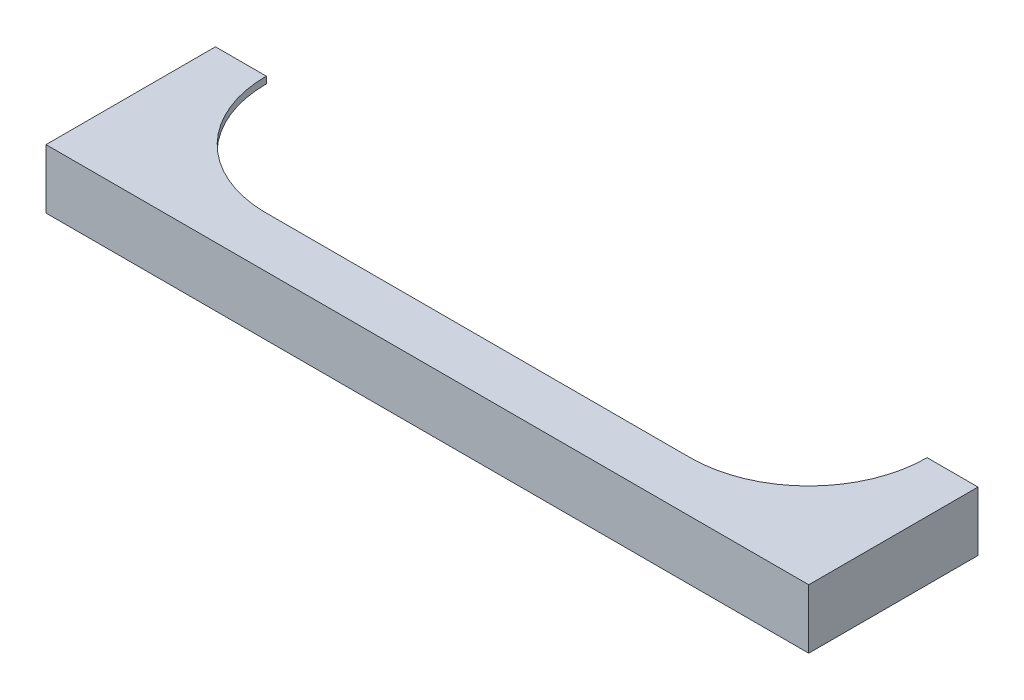
ISO-10303-21;
HEADER;
FILE_DESCRIPTION(('STEP AP214'),'2;1');
FILE_NAME('part.step','',(''),(''),'','','');
FILE_SCHEMA(('AUTOMOTIVE_DESIGN { 1 0 10303 214 1 1 1 1 }'));
ENDSEC;
DATA;
#1=APPLICATION_CONTEXT('core data for automotive mechanical design processes');
#2=APPLICATION_PROTOCOL_DEFINITION('international standard','automotive_design',2000,#1);
#3=PRODUCT_CONTEXT('',#1,'mechanical');
#4=PRODUCT('Part','Part','',(#3));
#5=PRODUCT_RELATED_PRODUCT_CATEGORY('part','',(#4));
#6=PRODUCT_DEFINITION_FORMATION('','',#4);
#7=PRODUCT_DEFINITION_CONTEXT('part definition',#1,'design');
#8=PRODUCT_DEFINITION('design','',#6,#7);
#9=PRODUCT_DEFINITION_SHAPE('','',#8);
#10=(LENGTH_UNIT() NAMED_UNIT(*) SI_UNIT(.MILLI.,.METRE.));
#11=(NAMED_UNIT(*) PLANE_ANGLE_UNIT() SI_UNIT($,.RADIAN.));
#12=(NAMED_UNIT(*) SI_UNIT($,.STERADIAN.) SOLID_ANGLE_UNIT());
#13=UNCERTAINTY_MEASURE_WITH_UNIT(LENGTH_MEASURE(1.E-05),#10,'distance_accuracy_value','');
#14=(GEOMETRIC_REPRESENTATION_CONTEXT(3) GLOBAL_UNCERTAINTY_ASSIGNED_CONTEXT((#13)) GLOBAL_UNIT_ASSIGNED_CONTEXT((#10,
#11,#12)) REPRESENTATION_CONTEXT('',''));
#15=CARTESIAN_POINT('',(0.,0.,0.));
#16=DIRECTION('',(0.,0.,1.));
#17=DIRECTION('',(1.,0.,0.));
#18=AXIS2_PLACEMENT_3D('',#15,#16,#17);
#19=CARTESIAN_POINT('',(-2500.,700.,-2000.));
#20=DIRECTION('',(0.,-1.,0.));
#21=DIRECTION('',(0.,0.,-1.));
#22=AXIS2_PLACEMENT_3D('',#19,#20,#21);
#23=CYLINDRICAL_SURFACE('',#22,1400.);
#24=CARTESIAN_POINT('',(-2500.,620.,-2000.));
#25=DIRECTION('',(0.,-1.,0.));
#26=DIRECTION('',(0.,0.,-1.));
#27=AXIS2_PLACEMENT_3D('',#24,#25,#26);
#28=CIRCLE('',#27,1400.);
#29=CARTESIAN_POINT('',(-3900.,620.,-2000.));
#30=VERTEX_POINT('',#29);
#31=CARTESIAN_POINT('',(-2537.88413687999,620.,-600.512668091326));
#32=VERTEX_POINT('',#31);
#33=EDGE_CURVE('E171',#30,#32,#28,.F.);
#34=ORIENTED_EDGE('',*,*,#33,.F.);
#35=DIRECTION('',(0.,-1.,0.));
#36=VECTOR('',#35,1.);
#37=CARTESIAN_POINT('',(-3900.,700.,-2000.));
#38=LINE('',#37,#36);
#39=CARTESIAN_POINT('',(-3900.,700.,-2000.));
#40=VERTEX_POINT('',#39);
#41=EDGE_CURVE('E46',#40,#30,#38,.T.);
#42=ORIENTED_EDGE('',*,*,#41,.F.);
#43=CARTESIAN_POINT('',(-2500.,700.,-2000.));
#44=DIRECTION('',(0.,-1.,0.));
#45=DIRECTION('',(0.,0.,1.));
#46=AXIS2_PLACEMENT_3D('',#43,#44,#45);
#47=CIRCLE('',#46,1400.);
#48=CARTESIAN_POINT('',(-2537.88413687999,700.,-600.512668091326));
#49=VERTEX_POINT('',#48);
#50=EDGE_CURVE('E149',#49,#40,#47,.T.);
#51=ORIENTED_EDGE('',*,*,#50,.F.);
#52=DIRECTION('',(0.,-1.,0.));
#53=VECTOR('',#52,1.);
#54=CARTESIAN_POINT('',(-2537.88413687999,700.,-600.512668091326));
#55=LINE('',#54,#53);
#56=EDGE_CURVE('E134',#49,#32,#55,.T.);
#57=ORIENTED_EDGE('',*,*,#56,.T.);
#58=EDGE_LOOP('',(#34,#42,#51,#57));
#59=FACE_BOUND('',#58,.T.);
#60=ADVANCED_FACE('F39',(#59),#23,.F.);
#61=CARTESIAN_POINT('',(-4500.,700.,-2000.));
#62=DIRECTION('',(0.,0.,1.));
#63=DIRECTION('',(1.,0.,0.));
#64=AXIS2_PLACEMENT_3D('',#61,#62,#63);
#65=PLANE('',#64);
#66=DIRECTION('',(1.,0.,0.));
#67=VECTOR('',#66,1.);
#68=CARTESIAN_POINT('',(-4500.,620.,-2000.));
#69=LINE('',#68,#67);
#70=CARTESIAN_POINT('',(-4460.,620.,-2000.));
#71=VERTEX_POINT('',#70);
#72=EDGE_CURVE('E141',#71,#30,#69,.T.);
#73=ORIENTED_EDGE('',*,*,#72,.F.);
#74=DIRECTION('',(0.,1.,0.));
#75=VECTOR('',#74,1.);
#76=CARTESIAN_POINT('',(-4460.,700.,-2000.));
#77=LINE('',#76,#75);
#78=CARTESIAN_POINT('',(-4460.,0.,-2000.));
#79=VERTEX_POINT('',#78);
#80=EDGE_CURVE('E221',#79,#71,#77,.T.);
#81=ORIENTED_EDGE('',*,*,#80,.F.);
#82=DIRECTION('',(-1.,0.,0.));
#83=VECTOR('',#82,1.);
#84=CARTESIAN_POINT('',(-4500.,0.,-2000.));
#85=LINE('',#84,#83);
#86=CARTESIAN_POINT('',(-4500.,0.,-2000.));
#87=VERTEX_POINT('',#86);
#88=EDGE_CURVE('E138',#79,#87,#85,.T.);
#89=ORIENTED_EDGE('',*,*,#88,.T.);
#90=DIRECTION('',(0.,-1.,0.));
#91=VECTOR('',#90,1.);
#92=CARTESIAN_POINT('',(-4500.,700.,-2000.));
#93=LINE('',#92,#91);
#94=CARTESIAN_POINT('',(-4500.,700.,-2000.));
#95=VERTEX_POINT('',#94);
#96=EDGE_CURVE('E159',#95,#87,#93,.T.);
#97=ORIENTED_EDGE('',*,*,#96,.F.);
#98=DIRECTION('',(-1.,0.,0.));
#99=VECTOR('',#98,1.);
#100=CARTESIAN_POINT('',(-4500.,700.,-2000.));
#101=LINE('',#100,#99);
#102=EDGE_CURVE('E93',#40,#95,#101,.T.);
#103=ORIENTED_EDGE('',*,*,#102,.F.);
#104=ORIENTED_EDGE('',*,*,#41,.T.);
#105=EDGE_LOOP('',(#73,#81,#89,#97,#103,#104));
#106=FACE_BOUND('',#105,.T.);
#107=ADVANCED_FACE('F163',(#106),#65,.F.);
#108=CARTESIAN_POINT('',(4500.,700.,-2000.));
#109=DIRECTION('',(0.,0.,1.));
#110=DIRECTION('',(1.,0.,0.));
#111=AXIS2_PLACEMENT_3D('',#108,#109,#110);
#112=PLANE('',#111);
#113=DIRECTION('',(0.,-1.,0.));
#114=VECTOR('',#113,1.);
#115=CARTESIAN_POINT('',(4460.,700.,-2000.));
#116=LINE('',#115,#114);
#117=CARTESIAN_POINT('',(4460.,620.,-2000.));
#118=VERTEX_POINT('',#117);
#119=CARTESIAN_POINT('',(4460.,0.,-2000.));
#120=VERTEX_POINT('',#119);
#121=EDGE_CURVE('E224',#118,#120,#116,.T.);
#122=ORIENTED_EDGE('',*,*,#121,.F.);
#123=DIRECTION('',(1.,0.,0.));
#124=VECTOR('',#123,1.);
#125=CARTESIAN_POINT('',(4500.,620.,-2000.));
#126=LINE('',#125,#124);
#127=CARTESIAN_POINT('',(3900.,620.,-2000.));
#128=VERTEX_POINT('',#127);
#129=EDGE_CURVE('E125',#128,#118,#126,.T.);
#130=ORIENTED_EDGE('',*,*,#129,.F.);
#131=DIRECTION('',(0.,-1.,0.));
#132=VECTOR('',#131,1.);
#133=CARTESIAN_POINT('',(3900.,700.,-2000.));
#134=LINE('',#133,#132);
#135=CARTESIAN_POINT('',(3900.,700.,-2000.));
#136=VERTEX_POINT('',#135);
#137=EDGE_CURVE('E120',#136,#128,#134,.T.);
#138=ORIENTED_EDGE('',*,*,#137,.F.);
#139=DIRECTION('',(-1.,0.,0.));
#140=VECTOR('',#139,1.);
#141=CARTESIAN_POINT('',(4500.,700.,-2000.));
#142=LINE('',#141,#140);
#143=CARTESIAN_POINT('',(4500.,700.,-2000.));
#144=VERTEX_POINT('',#143);
#145=EDGE_CURVE('E108',#144,#136,#142,.T.);
#146=ORIENTED_EDGE('',*,*,#145,.F.);
#147=DIRECTION('',(0.,-1.,0.));
#148=VECTOR('',#147,1.);
#149=CARTESIAN_POINT('',(4500.,700.,-2000.));
#150=LINE('',#149,#148);
#151=CARTESIAN_POINT('',(4500.,0.,-2000.));
#152=VERTEX_POINT('',#151);
#153=EDGE_CURVE('E128',#144,#152,#150,.T.);
#154=ORIENTED_EDGE('',*,*,#153,.T.);
#155=DIRECTION('',(-1.,0.,0.));
#156=VECTOR('',#155,1.);
#157=CARTESIAN_POINT('',(4500.,0.,-2000.));
#158=LINE('',#157,#156);
#159=EDGE_CURVE('E146',#152,#120,#158,.T.);
#160=ORIENTED_EDGE('',*,*,#159,.T.);
#161=EDGE_LOOP('',(#122,#130,#138,#146,#154,#160));
#162=FACE_BOUND('',#161,.T.);
#163=ADVANCED_FACE('F122',(#162),#112,.F.);
#164=CARTESIAN_POINT('',(2501.82940843479,700.,-2000.));
#165=DIRECTION('',(0.,-1.,0.));
#166=DIRECTION('',(0.,0.,-1.));
#167=AXIS2_PLACEMENT_3D('',#164,#165,#166);
#168=CYLINDRICAL_SURFACE('',#167,1398.17059156521);
#169=CARTESIAN_POINT('',(2501.82940843479,620.,-2000.));
#170=DIRECTION('',(0.,-1.,0.));
#171=DIRECTION('',(0.,0.,-1.));
#172=AXIS2_PLACEMENT_3D('',#169,#170,#171);
#173=CIRCLE('',#172,1398.17059156521);
#174=CARTESIAN_POINT('',(2501.82940843479,620.,-601.829408434792));
#175=VERTEX_POINT('',#174);
#176=EDGE_CURVE('E177',#175,#128,#173,.F.);
#177=ORIENTED_EDGE('',*,*,#176,.F.);
#178=DIRECTION('',(0.,-1.,0.));
#179=VECTOR('',#178,1.);
#180=CARTESIAN_POINT('',(2501.82940843479,700.,-601.829408434792));
#181=LINE('',#180,#179);
#182=CARTESIAN_POINT('',(2501.82940843479,700.,-601.829408434792));
#183=VERTEX_POINT('',#182);
#184=EDGE_CURVE('E129',#183,#175,#181,.T.);
#185=ORIENTED_EDGE('',*,*,#184,.F.);
#186=CARTESIAN_POINT('',(2501.82940843479,700.,-2000.));
#187=DIRECTION('',(0.,-1.,0.));
#188=DIRECTION('',(0.,0.,-1.));
#189=AXIS2_PLACEMENT_3D('',#186,#187,#188);
#190=CIRCLE('',#189,1398.17059156521);
#191=EDGE_CURVE('E112',#136,#183,#190,.T.);
#192=ORIENTED_EDGE('',*,*,#191,.F.);
#193=ORIENTED_EDGE('',*,*,#137,.T.);
#194=EDGE_LOOP('',(#177,#185,#192,#193));
#195=FACE_BOUND('',#194,.T.);
#196=ADVANCED_FACE('F131',(#195),#168,.F.);
#197=CARTESIAN_POINT('',(-2537.88413687999,700.,-600.512668091326));
#198=DIRECTION('',(0.000261272845506619,0.,0.999999965868249));
#199=DIRECTION('',(0.99999996586825,0.,-0.000261272845506619));
#200=AXIS2_PLACEMENT_3D('',#197,#198,#199);
#201=PLANE('',#200);
#202=DIRECTION('',(0.99999996586825,0.,-0.000261272845506619));
#203=VECTOR('',#202,1.);
#204=CARTESIAN_POINT('',(-2537.88413687999,620.,-600.512668091326));
#205=LINE('',#204,#203);
#206=EDGE_CURVE('E11',#32,#175,#205,.T.);
#207=ORIENTED_EDGE('',*,*,#206,.F.);
#208=ORIENTED_EDGE('',*,*,#56,.F.);
#209=DIRECTION('',(-0.99999996586825,0.,0.000261272845506619));
#210=VECTOR('',#209,1.);
#211=CARTESIAN_POINT('',(-2537.88413687999,700.,-600.512668091326));
#212=LINE('',#211,#210);
#213=EDGE_CURVE('E62',#183,#49,#212,.T.);
#214=ORIENTED_EDGE('',*,*,#213,.F.);
#215=ORIENTED_EDGE('',*,*,#184,.T.);
#216=EDGE_LOOP('',(#207,#208,#214,#215));
#217=FACE_BOUND('',#216,.T.);
#218=ADVANCED_FACE('F231',(#217),#201,.F.);
#219=CARTESIAN_POINT('',(-2500.,0.,-2000.));
#220=DIRECTION('',(0.,1.,0.));
#221=DIRECTION('',(0.,0.,1.));
#222=AXIS2_PLACEMENT_3D('',#219,#220,#221);
#223=PLANE('',#222);
#224=DIRECTION('',(0.,0.,-1.));
#225=VECTOR('',#224,1.);
#226=CARTESIAN_POINT('',(4460.,0.,-100.));
#227=LINE('',#226,#225);
#228=CARTESIAN_POINT('',(4460.,0.,-100.));
#229=VERTEX_POINT('',#228);
#230=EDGE_CURVE('E200',#229,#120,#227,.T.);
#231=ORIENTED_EDGE('',*,*,#230,.T.);
#232=ORIENTED_EDGE('',*,*,#159,.F.);
#233=DIRECTION('',(1.53773673066563E-07,0.,-0.999999999999988));
#234=VECTOR('',#233,1.);
#235=CARTESIAN_POINT('',(4499.99969281425,0.,-2.35145560956131));
#236=LINE('',#235,#234);
#237=CARTESIAN_POINT('',(4499.99969281425,0.,-2.35145560956131));
#238=VERTEX_POINT('',#237);
#239=EDGE_CURVE('E84',#238,#152,#236,.T.);
#240=ORIENTED_EDGE('',*,*,#239,.F.);
#241=DIRECTION('',(0.999999965868249,0.,-0.000261272845506812));
#242=VECTOR('',#241,1.);
#243=CARTESIAN_POINT('',(-4500.,0.,0.));
#244=LINE('',#243,#242);
#245=CARTESIAN_POINT('',(-4500.,0.,0.));
#246=VERTEX_POINT('',#245);
#247=EDGE_CURVE('E143',#246,#238,#244,.T.);
#248=ORIENTED_EDGE('',*,*,#247,.F.);
#249=DIRECTION('',(0.,0.,1.));
#250=VECTOR('',#249,1.);
#251=CARTESIAN_POINT('',(-4500.,0.,0.));
#252=LINE('',#251,#250);
#253=EDGE_CURVE('E140',#87,#246,#252,.T.);
#254=ORIENTED_EDGE('',*,*,#253,.F.);
#255=ORIENTED_EDGE('',*,*,#88,.F.);
#256=DIRECTION('',(0.,0.,-1.));
#257=VECTOR('',#256,1.);
#258=CARTESIAN_POINT('',(-4460.,0.,-100.));
#259=LINE('',#258,#257);
#260=CARTESIAN_POINT('',(-4460.,0.,-100.));
#261=VERTEX_POINT('',#260);
#262=EDGE_CURVE('E207',#261,#79,#259,.T.);
#263=ORIENTED_EDGE('',*,*,#262,.F.);
#264=DIRECTION('',(1.,0.,0.));
#265=VECTOR('',#264,1.);
#266=CARTESIAN_POINT('',(-4460.,0.,-100.));
#267=LINE('',#266,#265);
#268=EDGE_CURVE('E202',#261,#229,#267,.T.);
#269=ORIENTED_EDGE('',*,*,#268,.T.);
#270=EDGE_LOOP('',(#231,#232,#240,#248,#254,#255,#263,#269));
#271=FACE_BOUND('',#270,.T.);
#272=ADVANCED_FACE('F198',(#271),#223,.F.);
#273=CARTESIAN_POINT('',(-4500.,700.,0.));
#274=DIRECTION('',(1.,0.,0.));
#275=DIRECTION('',(0.,0.,-1.));
#276=AXIS2_PLACEMENT_3D('',#273,#274,#275);
#277=PLANE('',#276);
#278=ORIENTED_EDGE('',*,*,#253,.T.);
#279=DIRECTION('',(0.,-1.,0.));
#280=VECTOR('',#279,1.);
#281=CARTESIAN_POINT('',(-4500.,700.,0.));
#282=LINE('',#281,#280);
#283=CARTESIAN_POINT('',(-4500.,700.,0.));
#284=VERTEX_POINT('',#283);
#285=EDGE_CURVE('E156',#284,#246,#282,.T.);
#286=ORIENTED_EDGE('',*,*,#285,.F.);
#287=DIRECTION('',(0.,0.,1.));
#288=VECTOR('',#287,1.);
#289=CARTESIAN_POINT('',(-4500.,700.,0.));
#290=LINE('',#289,#288);
#291=EDGE_CURVE('E183',#95,#284,#290,.T.);
#292=ORIENTED_EDGE('',*,*,#291,.F.);
#293=ORIENTED_EDGE('',*,*,#96,.T.);
#294=EDGE_LOOP('',(#278,#286,#292,#293));
#295=FACE_BOUND('',#294,.T.);
#296=ADVANCED_FACE('F257',(#295),#277,.F.);
#297=CARTESIAN_POINT('',(-4500.,700.,0.));
#298=DIRECTION('',(-0.000261272845506812,0.,-0.999999965868249));
#299=DIRECTION('',(-0.99999996586825,0.,0.000261272845506812));
#300=AXIS2_PLACEMENT_3D('',#297,#298,#299);
#301=PLANE('',#300);
#302=ORIENTED_EDGE('',*,*,#247,.T.);
#303=DIRECTION('',(0.,-1.,0.));
#304=VECTOR('',#303,1.);
#305=CARTESIAN_POINT('',(4499.99969281425,700.,-2.35145560956131));
#306=LINE('',#305,#304);
#307=CARTESIAN_POINT('',(4499.99969281425,700.,-2.35145560956131));
#308=VERTEX_POINT('',#307);
#309=EDGE_CURVE('E154',#308,#238,#306,.T.);
#310=ORIENTED_EDGE('',*,*,#309,.F.);
#311=DIRECTION('',(0.999999965868249,0.,-0.000261272845506812));
#312=VECTOR('',#311,1.);
#313=CARTESIAN_POINT('',(-4500.,700.,0.));
#314=LINE('',#313,#312);
#315=EDGE_CURVE('E185',#284,#308,#314,.T.);
#316=ORIENTED_EDGE('',*,*,#315,.F.);
#317=ORIENTED_EDGE('',*,*,#285,.T.);
#318=EDGE_LOOP('',(#302,#310,#316,#317));
#319=FACE_BOUND('',#318,.T.);
#320=ADVANCED_FACE('F191',(#319),#301,.F.);
#321=CARTESIAN_POINT('',(4499.99969281425,700.,-2.35145560956131));
#322=DIRECTION('',(-0.999999999999988,0.,-1.53773673066563E-07));
#323=DIRECTION('',(-1.53773673066563E-07,0.,0.999999999999988));
#324=AXIS2_PLACEMENT_3D('',#321,#322,#323);
#325=PLANE('',#324);
#326=ORIENTED_EDGE('',*,*,#239,.T.);
#327=ORIENTED_EDGE('',*,*,#153,.F.);
#328=DIRECTION('',(1.53773673066563E-07,0.,-0.999999999999988));
#329=VECTOR('',#328,1.);
#330=CARTESIAN_POINT('',(4499.99969281425,700.,-2.35145560956131));
#331=LINE('',#330,#329);
#332=EDGE_CURVE('E115',#308,#144,#331,.T.);
#333=ORIENTED_EDGE('',*,*,#332,.F.);
#334=ORIENTED_EDGE('',*,*,#309,.T.);
#335=EDGE_LOOP('',(#326,#327,#333,#334));
#336=FACE_BOUND('',#335,.T.);
#337=ADVANCED_FACE('F193',(#336),#325,.F.);
#338=CARTESIAN_POINT('',(-2500.,700.,-2000.));
#339=DIRECTION('',(0.,1.,0.));
#340=DIRECTION('',(0.,0.,1.));
#341=AXIS2_PLACEMENT_3D('',#338,#339,#340);
#342=PLANE('',#341);
#343=ORIENTED_EDGE('',*,*,#50,.T.);
#344=ORIENTED_EDGE('',*,*,#102,.T.);
#345=ORIENTED_EDGE('',*,*,#291,.T.);
#346=ORIENTED_EDGE('',*,*,#315,.T.);
#347=ORIENTED_EDGE('',*,*,#332,.T.);
#348=ORIENTED_EDGE('',*,*,#145,.T.);
#349=ORIENTED_EDGE('',*,*,#191,.T.);
#350=ORIENTED_EDGE('',*,*,#213,.T.);
#351=EDGE_LOOP('',(#343,#344,#345,#346,#347,#348,#349,#350));
#352=FACE_BOUND('',#351,.T.);
#353=ADVANCED_FACE('F110',(#352),#342,.T.);
#354=CARTESIAN_POINT('',(4460.,620.,-100.));
#355=DIRECTION('',(0.,-1.,0.));
#356=DIRECTION('',(0.,0.,-1.));
#357=AXIS2_PLACEMENT_3D('',#354,#355,#356);
#358=PLANE('',#357);
#359=ORIENTED_EDGE('',*,*,#72,.T.);
#360=ORIENTED_EDGE('',*,*,#33,.T.);
#361=ORIENTED_EDGE('',*,*,#206,.T.);
#362=ORIENTED_EDGE('',*,*,#176,.T.);
#363=ORIENTED_EDGE('',*,*,#129,.T.);
#364=DIRECTION('',(0.,0.,-1.));
#365=VECTOR('',#364,1.);
#366=CARTESIAN_POINT('',(4460.,620.,-100.));
#367=LINE('',#366,#365);
#368=CARTESIAN_POINT('',(4460.,620.,-100.));
#369=VERTEX_POINT('',#368);
#370=EDGE_CURVE('E218',#369,#118,#367,.T.);
#371=ORIENTED_EDGE('',*,*,#370,.F.);
#372=DIRECTION('',(-1.,0.,0.));
#373=VECTOR('',#372,1.);
#374=CARTESIAN_POINT('',(4460.,620.,-100.));
#375=LINE('',#374,#373);
#376=CARTESIAN_POINT('',(-4460.,620.,-100.));
#377=VERTEX_POINT('',#376);
#378=EDGE_CURVE('E246',#369,#377,#375,.T.);
#379=ORIENTED_EDGE('',*,*,#378,.T.);
#380=DIRECTION('',(0.,0.,-1.));
#381=VECTOR('',#380,1.);
#382=CARTESIAN_POINT('',(-4460.,620.,-100.));
#383=LINE('',#382,#381);
#384=EDGE_CURVE('E210',#377,#71,#383,.T.);
#385=ORIENTED_EDGE('',*,*,#384,.T.);
#386=EDGE_LOOP('',(#359,#360,#361,#362,#363,#371,#379,#385));
#387=FACE_BOUND('',#386,.T.);
#388=ADVANCED_FACE('F226',(#387),#358,.T.);
#389=CARTESIAN_POINT('',(4460.,0.,-100.));
#390=DIRECTION('',(-1.,0.,0.));
#391=DIRECTION('',(0.,0.,1.));
#392=AXIS2_PLACEMENT_3D('',#389,#390,#391);
#393=PLANE('',#392);
#394=ORIENTED_EDGE('',*,*,#121,.T.);
#395=ORIENTED_EDGE('',*,*,#230,.F.);
#396=DIRECTION('',(0.,1.,0.));
#397=VECTOR('',#396,1.);
#398=CARTESIAN_POINT('',(4460.,0.,-100.));
#399=LINE('',#398,#397);
#400=EDGE_CURVE('E53',#229,#369,#399,.T.);
#401=ORIENTED_EDGE('',*,*,#400,.T.);
#402=ORIENTED_EDGE('',*,*,#370,.T.);
#403=EDGE_LOOP('',(#394,#395,#401,#402));
#404=FACE_BOUND('',#403,.T.);
#405=ADVANCED_FACE('F250',(#404),#393,.T.);
#406=CARTESIAN_POINT('',(-4460.,620.,-100.));
#407=DIRECTION('',(1.,0.,0.));
#408=DIRECTION('',(0.,0.,-1.));
#409=AXIS2_PLACEMENT_3D('',#406,#407,#408);
#410=PLANE('',#409);
#411=ORIENTED_EDGE('',*,*,#80,.T.);
#412=ORIENTED_EDGE('',*,*,#384,.F.);
#413=DIRECTION('',(0.,-1.,0.));
#414=VECTOR('',#413,1.);
#415=CARTESIAN_POINT('',(-4460.,620.,-100.));
#416=LINE('',#415,#414);
#417=EDGE_CURVE('E212',#377,#261,#416,.T.);
#418=ORIENTED_EDGE('',*,*,#417,.T.);
#419=ORIENTED_EDGE('',*,*,#262,.T.);
#420=EDGE_LOOP('',(#411,#412,#418,#419));
#421=FACE_BOUND('',#420,.T.);
#422=ADVANCED_FACE('F253',(#421),#410,.T.);
#423=CARTESIAN_POINT('',(0.,0.,-100.));
#424=DIRECTION('',(0.,0.,1.));
#425=DIRECTION('',(1.,0.,0.));
#426=AXIS2_PLACEMENT_3D('',#423,#424,#425);
#427=PLANE('',#426);
#428=ORIENTED_EDGE('',*,*,#400,.F.);
#429=ORIENTED_EDGE('',*,*,#268,.F.);
#430=ORIENTED_EDGE('',*,*,#417,.F.);
#431=ORIENTED_EDGE('',*,*,#378,.F.);
#432=EDGE_LOOP('',(#428,#429,#430,#431));
#433=FACE_BOUND('',#432,.T.);
#434=ADVANCED_FACE('F247',(#433),#427,.F.);
#435=CLOSED_SHELL('',(#60,#107,#163,#196,#218,#272,#296,#320,#337,#353,#388,#405,#422,#434));
#436=MANIFOLD_SOLID_BREP('B2',#435);
#437=ADVANCED_BREP_SHAPE_REPRESENTATION('',(#18,#436),#14);
#438=SHAPE_DEFINITION_REPRESENTATION(#9,#437);
ENDSEC;
END-ISO-10303-21;
